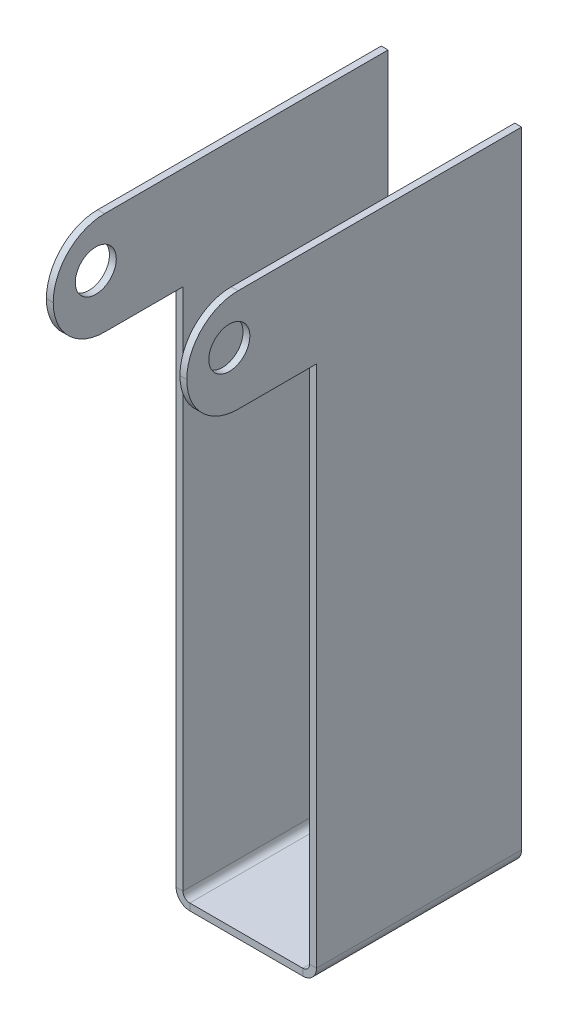
ISO-10303-21;
HEADER;
FILE_DESCRIPTION(('STEP AP214'),'2;1');
FILE_NAME('part.step','',(''),(''),'','','');
FILE_SCHEMA(('AUTOMOTIVE_DESIGN { 1 0 10303 214 1 1 1 1 }'));
ENDSEC;
DATA;
#1=APPLICATION_CONTEXT('core data for automotive mechanical design processes');
#2=APPLICATION_PROTOCOL_DEFINITION('international standard','automotive_design',2000,#1);
#3=PRODUCT_CONTEXT('',#1,'mechanical');
#4=PRODUCT('Part','Part','',(#3));
#5=PRODUCT_RELATED_PRODUCT_CATEGORY('part','',(#4));
#6=PRODUCT_DEFINITION_FORMATION('','',#4);
#7=PRODUCT_DEFINITION_CONTEXT('part definition',#1,'design');
#8=PRODUCT_DEFINITION('design','',#6,#7);
#9=PRODUCT_DEFINITION_SHAPE('','',#8);
#10=(LENGTH_UNIT() NAMED_UNIT(*) SI_UNIT(.MILLI.,.METRE.));
#11=(NAMED_UNIT(*) PLANE_ANGLE_UNIT() SI_UNIT($,.RADIAN.));
#12=(NAMED_UNIT(*) SI_UNIT($,.STERADIAN.) SOLID_ANGLE_UNIT());
#13=UNCERTAINTY_MEASURE_WITH_UNIT(LENGTH_MEASURE(1.E-05),#10,'distance_accuracy_value','');
#14=(GEOMETRIC_REPRESENTATION_CONTEXT(3) GLOBAL_UNCERTAINTY_ASSIGNED_CONTEXT((#13)) GLOBAL_UNIT_ASSIGNED_CONTEXT((#10,
#11,#12)) REPRESENTATION_CONTEXT('',''));
#15=CARTESIAN_POINT('',(0.,0.,0.));
#16=DIRECTION('',(0.,0.,1.));
#17=DIRECTION('',(1.,0.,0.));
#18=AXIS2_PLACEMENT_3D('',#15,#16,#17);
#19=CARTESIAN_POINT('',(-1.00000000000032,92.54,30.));
#20=DIRECTION('',(0.,0.,-1.));
#21=DIRECTION('',(-1.,0.,0.));
#22=AXIS2_PLACEMENT_3D('',#19,#20,#21);
#23=PLANE('',#22);
#24=DIRECTION('',(-1.,0.,0.));
#25=VECTOR('',#24,1.);
#26=CARTESIAN_POINT('',(-2.7148422399037E-13,77.54,30.));
#27=LINE('',#26,#25);
#28=CARTESIAN_POINT('',(-2.7148422399037E-13,77.54,30.));
#29=VERTEX_POINT('',#28);
#30=CARTESIAN_POINT('',(-1.00000000000027,77.54,30.));
#31=VERTEX_POINT('',#30);
#32=EDGE_CURVE('E175',#29,#31,#27,.T.);
#33=ORIENTED_EDGE('',*,*,#32,.T.);
#34=DIRECTION('',(0.,1.,0.));
#35=VECTOR('',#34,1.);
#36=CARTESIAN_POINT('',(-1.00000000000032,92.54,30.));
#37=LINE('',#36,#35);
#38=CARTESIAN_POINT('',(-1.,0.999999999999993,30.));
#39=VERTEX_POINT('',#38);
#40=EDGE_CURVE('E201',#39,#31,#37,.T.);
#41=ORIENTED_EDGE('',*,*,#40,.F.);
#42=DIRECTION('',(-1.,0.,0.));
#43=VECTOR('',#42,1.);
#44=CARTESIAN_POINT('',(0.,0.999999999999997,30.));
#45=LINE('',#44,#43);
#46=CARTESIAN_POINT('',(0.,0.999999999999997,30.));
#47=VERTEX_POINT('',#46);
#48=EDGE_CURVE('E188',#47,#39,#45,.T.);
#49=ORIENTED_EDGE('',*,*,#48,.F.);
#50=DIRECTION('',(0.,1.,0.));
#51=VECTOR('',#50,1.);
#52=CARTESIAN_POINT('',(-3.23101683096544E-13,92.54,30.));
#53=LINE('',#52,#51);
#54=EDGE_CURVE('E169',#47,#29,#53,.T.);
#55=ORIENTED_EDGE('',*,*,#54,.T.);
#56=EDGE_LOOP('',(#33,#41,#49,#55));
#57=FACE_BOUND('',#56,.T.);
#58=ADVANCED_FACE('F39',(#57),#23,.F.);
#59=CARTESIAN_POINT('',(0.,-1.,30.));
#60=DIRECTION('',(0.,1.,0.));
#61=DIRECTION('',(0.,0.,1.));
#62=AXIS2_PLACEMENT_3D('',#59,#60,#61);
#63=PLANE('',#62);
#64=DIRECTION('',(0.,0.,1.));
#65=VECTOR('',#64,1.);
#66=CARTESIAN_POINT('',(0.999999999999997,-1.,30.));
#67=LINE('',#66,#65);
#68=CARTESIAN_POINT('',(0.999999999999997,-1.,30.));
#69=VERTEX_POINT('',#68);
#70=CARTESIAN_POINT('',(0.999999999999997,-1.,0.));
#71=VERTEX_POINT('',#70);
#72=EDGE_CURVE('E206',#69,#71,#67,.F.);
#73=ORIENTED_EDGE('',*,*,#72,.T.);
#74=DIRECTION('',(1.,0.,0.));
#75=VECTOR('',#74,1.);
#76=CARTESIAN_POINT('',(0.,-1.,0.));
#77=LINE('',#76,#75);
#78=CARTESIAN_POINT('',(17.53,-1.,0.));
#79=VERTEX_POINT('',#78);
#80=EDGE_CURVE('E279',#71,#79,#77,.T.);
#81=ORIENTED_EDGE('',*,*,#80,.T.);
#82=DIRECTION('',(0.,0.,-1.));
#83=VECTOR('',#82,1.);
#84=CARTESIAN_POINT('',(17.53,-1.,0.));
#85=LINE('',#84,#83);
#86=CARTESIAN_POINT('',(17.53,-1.,30.));
#87=VERTEX_POINT('',#86);
#88=EDGE_CURVE('E258',#79,#87,#85,.F.);
#89=ORIENTED_EDGE('',*,*,#88,.T.);
#90=DIRECTION('',(1.,0.,0.));
#91=VECTOR('',#90,1.);
#92=CARTESIAN_POINT('',(0.,-1.,30.));
#93=LINE('',#92,#91);
#94=EDGE_CURVE('E281',#69,#87,#93,.T.);
#95=ORIENTED_EDGE('',*,*,#94,.F.);
#96=EDGE_LOOP('',(#73,#81,#89,#95));
#97=FACE_BOUND('',#96,.T.);
#98=ADVANCED_FACE('F368',(#97),#63,.F.);
#99=CARTESIAN_POINT('',(0.,0.,30.));
#100=DIRECTION('',(0.,1.,0.));
#101=DIRECTION('',(0.,0.,1.));
#102=AXIS2_PLACEMENT_3D('',#99,#100,#101);
#103=PLANE('',#102);
#104=DIRECTION('',(1.,0.,0.));
#105=VECTOR('',#104,1.);
#106=CARTESIAN_POINT('',(0.,0.,0.));
#107=LINE('',#106,#105);
#108=CARTESIAN_POINT('',(0.999999999999997,0.,0.));
#109=VERTEX_POINT('',#108);
#110=CARTESIAN_POINT('',(17.53,0.,0.));
#111=VERTEX_POINT('',#110);
#112=EDGE_CURVE('E284',#109,#111,#107,.T.);
#113=ORIENTED_EDGE('',*,*,#112,.F.);
#114=DIRECTION('',(0.,0.,1.));
#115=VECTOR('',#114,1.);
#116=CARTESIAN_POINT('',(0.999999999999997,0.,30.));
#117=LINE('',#116,#115);
#118=CARTESIAN_POINT('',(0.999999999999997,0.,30.));
#119=VERTEX_POINT('',#118);
#120=EDGE_CURVE('E219',#119,#109,#117,.F.);
#121=ORIENTED_EDGE('',*,*,#120,.F.);
#122=DIRECTION('',(1.,0.,0.));
#123=VECTOR('',#122,1.);
#124=CARTESIAN_POINT('',(0.,0.,30.));
#125=LINE('',#124,#123);
#126=CARTESIAN_POINT('',(17.53,0.,30.));
#127=VERTEX_POINT('',#126);
#128=EDGE_CURVE('E283',#119,#127,#125,.T.);
#129=ORIENTED_EDGE('',*,*,#128,.T.);
#130=DIRECTION('',(0.,0.,-1.));
#131=VECTOR('',#130,1.);
#132=CARTESIAN_POINT('',(17.53,0.,0.));
#133=LINE('',#132,#131);
#134=EDGE_CURVE('E271',#111,#127,#133,.F.);
#135=ORIENTED_EDGE('',*,*,#134,.F.);
#136=EDGE_LOOP('',(#113,#121,#129,#135));
#137=FACE_BOUND('',#136,.T.);
#138=ADVANCED_FACE('F373',(#137),#103,.T.);
#139=CARTESIAN_POINT('',(0.,0.,30.));
#140=DIRECTION('',(0.,0.,-1.));
#141=DIRECTION('',(-1.,0.,0.));
#142=AXIS2_PLACEMENT_3D('',#139,#140,#141);
#143=PLANE('',#142);
#144=DIRECTION('',(0.,-1.,0.));
#145=VECTOR('',#144,1.);
#146=CARTESIAN_POINT('',(0.999999999999997,0.,30.));
#147=LINE('',#146,#145);
#148=EDGE_CURVE('E213',#119,#69,#147,.T.);
#149=ORIENTED_EDGE('',*,*,#148,.T.);
#150=ORIENTED_EDGE('',*,*,#94,.T.);
#151=DIRECTION('',(0.,-1.,0.));
#152=VECTOR('',#151,1.);
#153=CARTESIAN_POINT('',(17.53,0.,30.));
#154=LINE('',#153,#152);
#155=EDGE_CURVE('E276',#127,#87,#154,.T.);
#156=ORIENTED_EDGE('',*,*,#155,.F.);
#157=ORIENTED_EDGE('',*,*,#128,.F.);
#158=EDGE_LOOP('',(#149,#150,#156,#157));
#159=FACE_BOUND('',#158,.T.);
#160=ADVANCED_FACE('F433',(#159),#143,.F.);
#161=CARTESIAN_POINT('',(0.,0.,0.));
#162=DIRECTION('',(0.,0.,-1.));
#163=DIRECTION('',(-1.,0.,0.));
#164=AXIS2_PLACEMENT_3D('',#161,#162,#163);
#165=PLANE('',#164);
#166=DIRECTION('',(0.,-1.,0.));
#167=VECTOR('',#166,1.);
#168=CARTESIAN_POINT('',(0.999999999999997,0.,0.));
#169=LINE('',#168,#167);
#170=EDGE_CURVE('E224',#109,#71,#169,.T.);
#171=ORIENTED_EDGE('',*,*,#170,.F.);
#172=ORIENTED_EDGE('',*,*,#112,.T.);
#173=DIRECTION('',(0.,-1.,0.));
#174=VECTOR('',#173,1.);
#175=CARTESIAN_POINT('',(17.53,0.,0.));
#176=LINE('',#175,#174);
#177=EDGE_CURVE('E265',#111,#79,#176,.T.);
#178=ORIENTED_EDGE('',*,*,#177,.T.);
#179=ORIENTED_EDGE('',*,*,#80,.F.);
#180=EDGE_LOOP('',(#171,#172,#178,#179));
#181=FACE_BOUND('',#180,.T.);
#182=ADVANCED_FACE('F428',(#181),#165,.T.);
#183=CARTESIAN_POINT('',(17.53,1.,30.));
#184=DIRECTION('',(0.,0.,1.));
#185=DIRECTION('',(1.,0.,0.));
#186=AXIS2_PLACEMENT_3D('',#183,#184,#185);
#187=PLANE('',#186);
#188=DIRECTION('',(1.,0.,0.));
#189=VECTOR('',#188,1.);
#190=CARTESIAN_POINT('',(18.53,0.999999999999997,30.));
#191=LINE('',#190,#189);
#192=CARTESIAN_POINT('',(18.53,0.999999999999997,30.));
#193=VERTEX_POINT('',#192);
#194=CARTESIAN_POINT('',(19.53,0.999999999999994,30.));
#195=VERTEX_POINT('',#194);
#196=EDGE_CURVE('E227',#193,#195,#191,.T.);
#197=ORIENTED_EDGE('',*,*,#196,.F.);
#198=CARTESIAN_POINT('',(17.53,1.,30.));
#199=DIRECTION('',(0.,0.,-1.));
#200=DIRECTION('',(-1.,0.,0.));
#201=AXIS2_PLACEMENT_3D('',#198,#199,#200);
#202=CIRCLE('',#201,1.);
#203=EDGE_CURVE('E268',#127,#193,#202,.F.);
#204=ORIENTED_EDGE('',*,*,#203,.F.);
#205=ORIENTED_EDGE('',*,*,#155,.T.);
#206=CARTESIAN_POINT('',(17.53,1.,30.));
#207=DIRECTION('',(0.,0.,-1.));
#208=DIRECTION('',(-1.,0.,0.));
#209=AXIS2_PLACEMENT_3D('',#206,#207,#208);
#210=CIRCLE('',#209,2.);
#211=EDGE_CURVE('E261',#87,#195,#210,.F.);
#212=ORIENTED_EDGE('',*,*,#211,.T.);
#213=EDGE_LOOP('',(#197,#204,#205,#212));
#214=FACE_BOUND('',#213,.T.);
#215=ADVANCED_FACE('F425',(#214),#187,.T.);
#216=CARTESIAN_POINT('',(17.53,1.,0.));
#217=DIRECTION('',(0.,0.,1.));
#218=DIRECTION('',(1.,0.,0.));
#219=AXIS2_PLACEMENT_3D('',#216,#217,#218);
#220=PLANE('',#219);
#221=CARTESIAN_POINT('',(17.53,1.,0.));
#222=DIRECTION('',(0.,0.,-1.));
#223=DIRECTION('',(-1.,0.,0.));
#224=AXIS2_PLACEMENT_3D('',#221,#222,#223);
#225=CIRCLE('',#224,1.);
#226=CARTESIAN_POINT('',(18.53,0.999999999999997,0.));
#227=VERTEX_POINT('',#226);
#228=EDGE_CURVE('E257',#227,#111,#225,.T.);
#229=ORIENTED_EDGE('',*,*,#228,.F.);
#230=DIRECTION('',(1.,0.,0.));
#231=VECTOR('',#230,1.);
#232=CARTESIAN_POINT('',(18.53,0.999999999999997,0.));
#233=LINE('',#232,#231);
#234=CARTESIAN_POINT('',(19.53,0.999999999999994,0.));
#235=VERTEX_POINT('',#234);
#236=EDGE_CURVE('E232',#227,#235,#233,.T.);
#237=ORIENTED_EDGE('',*,*,#236,.T.);
#238=CARTESIAN_POINT('',(17.53,1.,0.));
#239=DIRECTION('',(0.,0.,-1.));
#240=DIRECTION('',(-1.,0.,0.));
#241=AXIS2_PLACEMENT_3D('',#238,#239,#240);
#242=CIRCLE('',#241,2.);
#243=EDGE_CURVE('E262',#235,#79,#242,.T.);
#244=ORIENTED_EDGE('',*,*,#243,.T.);
#245=ORIENTED_EDGE('',*,*,#177,.F.);
#246=EDGE_LOOP('',(#229,#237,#244,#245));
#247=FACE_BOUND('',#246,.T.);
#248=ADVANCED_FACE('F420',(#247),#220,.F.);
#249=CARTESIAN_POINT('',(17.53,1.,0.));
#250=DIRECTION('',(0.,0.,-1.));
#251=DIRECTION('',(1.,0.,0.));
#252=AXIS2_PLACEMENT_3D('',#249,#250,#251);
#253=CYLINDRICAL_SURFACE('',#252,2.);
#254=ORIENTED_EDGE('',*,*,#88,.F.);
#255=ORIENTED_EDGE('',*,*,#243,.F.);
#256=DIRECTION('',(0.,0.,1.));
#257=VECTOR('',#256,1.);
#258=CARTESIAN_POINT('',(19.53,0.999999999999994,0.));
#259=LINE('',#258,#257);
#260=EDGE_CURVE('E235',#235,#195,#259,.T.);
#261=ORIENTED_EDGE('',*,*,#260,.T.);
#262=ORIENTED_EDGE('',*,*,#211,.F.);
#263=EDGE_LOOP('',(#254,#255,#261,#262));
#264=FACE_BOUND('',#263,.T.);
#265=ADVANCED_FACE('F417',(#264),#253,.T.);
#266=CARTESIAN_POINT('',(17.53,1.,0.));
#267=DIRECTION('',(0.,0.,-1.));
#268=DIRECTION('',(1.,0.,0.));
#269=AXIS2_PLACEMENT_3D('',#266,#267,#268);
#270=CYLINDRICAL_SURFACE('',#269,1.);
#271=ORIENTED_EDGE('',*,*,#134,.T.);
#272=ORIENTED_EDGE('',*,*,#203,.T.);
#273=DIRECTION('',(0.,0.,-1.));
#274=VECTOR('',#273,1.);
#275=CARTESIAN_POINT('',(18.53,0.999999999999997,30.));
#276=LINE('',#275,#274);
#277=EDGE_CURVE('E230',#193,#227,#276,.T.);
#278=ORIENTED_EDGE('',*,*,#277,.T.);
#279=ORIENTED_EDGE('',*,*,#228,.T.);
#280=EDGE_LOOP('',(#271,#272,#278,#279));
#281=FACE_BOUND('',#280,.T.);
#282=ADVANCED_FACE('F415',(#281),#270,.F.);
#283=CARTESIAN_POINT('',(19.53,0.,30.));
#284=DIRECTION('',(0.,0.,-1.));
#285=DIRECTION('',(-1.,0.,0.));
#286=AXIS2_PLACEMENT_3D('',#283,#284,#285);
#287=PLANE('',#286);
#288=DIRECTION('',(0.,-1.,0.));
#289=VECTOR('',#288,1.);
#290=CARTESIAN_POINT('',(19.53,0.,30.));
#291=LINE('',#290,#289);
#292=CARTESIAN_POINT('',(19.5300000000003,77.54,30.));
#293=VERTEX_POINT('',#292);
#294=EDGE_CURVE('E241',#293,#195,#291,.T.);
#295=ORIENTED_EDGE('',*,*,#294,.F.);
#296=DIRECTION('',(1.,0.,0.));
#297=VECTOR('',#296,1.);
#298=CARTESIAN_POINT('',(18.5300000000003,77.54,30.));
#299=LINE('',#298,#297);
#300=CARTESIAN_POINT('',(18.5300000000003,77.54,30.));
#301=VERTEX_POINT('',#300);
#302=EDGE_CURVE('E339',#301,#293,#299,.T.);
#303=ORIENTED_EDGE('',*,*,#302,.F.);
#304=DIRECTION('',(0.,-1.,0.));
#305=VECTOR('',#304,1.);
#306=CARTESIAN_POINT('',(18.53,0.,30.));
#307=LINE('',#306,#305);
#308=EDGE_CURVE('E240',#301,#193,#307,.T.);
#309=ORIENTED_EDGE('',*,*,#308,.T.);
#310=ORIENTED_EDGE('',*,*,#196,.T.);
#311=EDGE_LOOP('',(#295,#303,#309,#310));
#312=FACE_BOUND('',#311,.T.);
#313=ADVANCED_FACE('F411',(#312),#287,.F.);
#314=CARTESIAN_POINT('',(19.5300000000003,92.54,0.));
#315=DIRECTION('',(0.,0.,1.));
#316=DIRECTION('',(1.,0.,0.));
#317=AXIS2_PLACEMENT_3D('',#314,#315,#316);
#318=PLANE('',#317);
#319=ORIENTED_EDGE('',*,*,#236,.F.);
#320=DIRECTION('',(0.,1.,0.));
#321=VECTOR('',#320,1.);
#322=CARTESIAN_POINT('',(18.5300000000003,92.54,0.));
#323=LINE('',#322,#321);
#324=CARTESIAN_POINT('',(18.5300000000003,92.54,0.));
#325=VERTEX_POINT('',#324);
#326=EDGE_CURVE('E251',#227,#325,#323,.T.);
#327=ORIENTED_EDGE('',*,*,#326,.T.);
#328=DIRECTION('',(-1.,0.,0.));
#329=VECTOR('',#328,1.);
#330=CARTESIAN_POINT('',(19.5300000000003,92.54,0.));
#331=LINE('',#330,#329);
#332=CARTESIAN_POINT('',(19.5300000000003,92.54,0.));
#333=VERTEX_POINT('',#332);
#334=EDGE_CURVE('E249',#333,#325,#331,.T.);
#335=ORIENTED_EDGE('',*,*,#334,.F.);
#336=DIRECTION('',(0.,1.,0.));
#337=VECTOR('',#336,1.);
#338=CARTESIAN_POINT('',(19.5300000000003,92.54,0.));
#339=LINE('',#338,#337);
#340=EDGE_CURVE('E243',#235,#333,#339,.T.);
#341=ORIENTED_EDGE('',*,*,#340,.F.);
#342=EDGE_LOOP('',(#319,#327,#335,#341));
#343=FACE_BOUND('',#342,.T.);
#344=ADVANCED_FACE('F401',(#343),#318,.F.);
#345=CARTESIAN_POINT('',(19.53,0.,0.));
#346=DIRECTION('',(-1.,0.,0.));
#347=DIRECTION('',(0.,-1.,0.));
#348=AXIS2_PLACEMENT_3D('',#345,#346,#347);
#349=PLANE('',#348);
#350=CARTESIAN_POINT('',(19.5300000000003,85.96,42.7463768961494));
#351=DIRECTION('',(1.,0.,0.));
#352=DIRECTION('',(0.,1.,0.));
#353=AXIS2_PLACEMENT_3D('',#350,#351,#352);
#354=CIRCLE('',#353,3.);
#355=CARTESIAN_POINT('',(19.5300000000003,88.96,42.7463768961494));
#356=VERTEX_POINT('',#355);
#357=EDGE_CURVE('E315',#356,#356,#354,.T.);
#358=ORIENTED_EDGE('',*,*,#357,.F.);
#359=EDGE_LOOP('',(#358));
#360=FACE_BOUND('',#359,.T.);
#361=CARTESIAN_POINT('',(19.5300000000003,85.04,41.47));
#362=DIRECTION('',(-1.,0.,0.));
#363=DIRECTION('',(0.,-1.,0.));
#364=AXIS2_PLACEMENT_3D('',#361,#362,#363);
#365=CIRCLE('',#364,7.5);
#366=CARTESIAN_POINT('',(19.5300000000003,92.54,41.47));
#367=VERTEX_POINT('',#366);
#368=CARTESIAN_POINT('',(19.5300000000003,85.04,48.97));
#369=VERTEX_POINT('',#368);
#370=EDGE_CURVE('E286',#367,#369,#365,.F.);
#371=ORIENTED_EDGE('',*,*,#370,.T.);
#372=CARTESIAN_POINT('',(19.5300000000003,85.04,41.47));
#373=DIRECTION('',(-1.,0.,0.));
#374=DIRECTION('',(0.,-1.,0.));
#375=AXIS2_PLACEMENT_3D('',#372,#373,#374);
#376=CIRCLE('',#375,7.5);
#377=CARTESIAN_POINT('',(19.5300000000003,77.54,41.47));
#378=VERTEX_POINT('',#377);
#379=EDGE_CURVE('E296',#369,#378,#376,.F.);
#380=ORIENTED_EDGE('',*,*,#379,.T.);
#381=DIRECTION('',(0.,0.,-1.));
#382=VECTOR('',#381,1.);
#383=CARTESIAN_POINT('',(19.5300000000003,77.54,30.));
#384=LINE('',#383,#382);
#385=EDGE_CURVE('E184',#378,#293,#384,.T.);
#386=ORIENTED_EDGE('',*,*,#385,.T.);
#387=ORIENTED_EDGE('',*,*,#294,.T.);
#388=ORIENTED_EDGE('',*,*,#260,.F.);
#389=ORIENTED_EDGE('',*,*,#340,.T.);
#390=DIRECTION('',(0.,0.,1.));
#391=VECTOR('',#390,1.);
#392=CARTESIAN_POINT('',(19.5300000000003,92.54,30.));
#393=LINE('',#392,#391);
#394=EDGE_CURVE('E246',#333,#367,#393,.T.);
#395=ORIENTED_EDGE('',*,*,#394,.T.);
#396=EDGE_LOOP('',(#371,#380,#386,#387,#388,#389,#395));
#397=FACE_BOUND('',#396,.T.);
#398=ADVANCED_FACE('F397',(#360,#397),#349,.F.);
#399=CARTESIAN_POINT('',(18.53,0.,0.));
#400=DIRECTION('',(-1.,0.,0.));
#401=DIRECTION('',(0.,-1.,0.));
#402=AXIS2_PLACEMENT_3D('',#399,#400,#401);
#403=PLANE('',#402);
#404=CARTESIAN_POINT('',(18.5300000000003,85.96,42.7463768961494));
#405=DIRECTION('',(-1.,0.,0.));
#406=DIRECTION('',(0.,-1.,0.));
#407=AXIS2_PLACEMENT_3D('',#404,#405,#406);
#408=CIRCLE('',#407,3.);
#409=CARTESIAN_POINT('',(18.5300000000003,82.96,42.7463768961494));
#410=VERTEX_POINT('',#409);
#411=EDGE_CURVE('E293',#410,#410,#408,.T.);
#412=ORIENTED_EDGE('',*,*,#411,.F.);
#413=EDGE_LOOP('',(#412));
#414=FACE_BOUND('',#413,.T.);
#415=DIRECTION('',(0.,0.,-1.));
#416=VECTOR('',#415,1.);
#417=CARTESIAN_POINT('',(18.5300000000003,77.54,30.));
#418=LINE('',#417,#416);
#419=CARTESIAN_POINT('',(18.5300000000003,77.54,41.47));
#420=VERTEX_POINT('',#419);
#421=EDGE_CURVE('E344',#420,#301,#418,.T.);
#422=ORIENTED_EDGE('',*,*,#421,.F.);
#423=CARTESIAN_POINT('',(18.5300000000003,85.04,41.47));
#424=DIRECTION('',(-1.,0.,0.));
#425=DIRECTION('',(0.,-1.,0.));
#426=AXIS2_PLACEMENT_3D('',#423,#424,#425);
#427=CIRCLE('',#426,7.5);
#428=CARTESIAN_POINT('',(18.5300000000003,85.04,48.97));
#429=VERTEX_POINT('',#428);
#430=EDGE_CURVE('E303',#420,#429,#427,.T.);
#431=ORIENTED_EDGE('',*,*,#430,.T.);
#432=CARTESIAN_POINT('',(18.5300000000003,85.04,41.47));
#433=DIRECTION('',(-1.,0.,0.));
#434=DIRECTION('',(0.,-1.,0.));
#435=AXIS2_PLACEMENT_3D('',#432,#433,#434);
#436=CIRCLE('',#435,7.5);
#437=CARTESIAN_POINT('',(18.5300000000003,92.54,41.47));
#438=VERTEX_POINT('',#437);
#439=EDGE_CURVE('E301',#429,#438,#436,.T.);
#440=ORIENTED_EDGE('',*,*,#439,.T.);
#441=DIRECTION('',(0.,0.,1.));
#442=VECTOR('',#441,1.);
#443=CARTESIAN_POINT('',(18.5300000000003,92.54,30.));
#444=LINE('',#443,#442);
#445=EDGE_CURVE('E244',#325,#438,#444,.T.);
#446=ORIENTED_EDGE('',*,*,#445,.F.);
#447=ORIENTED_EDGE('',*,*,#326,.F.);
#448=ORIENTED_EDGE('',*,*,#277,.F.);
#449=ORIENTED_EDGE('',*,*,#308,.F.);
#450=EDGE_LOOP('',(#422,#431,#440,#446,#447,#448,#449));
#451=FACE_BOUND('',#450,.T.);
#452=ADVANCED_FACE('F400',(#414,#451),#403,.T.);
#453=CARTESIAN_POINT('',(19.5300000000003,92.54,30.));
#454=DIRECTION('',(0.,-1.,0.));
#455=DIRECTION('',(1.,0.,0.));
#456=AXIS2_PLACEMENT_3D('',#453,#454,#455);
#457=PLANE('',#456);
#458=ORIENTED_EDGE('',*,*,#445,.T.);
#459=DIRECTION('',(1.,0.,0.));
#460=VECTOR('',#459,1.);
#461=CARTESIAN_POINT('',(19.5300000000003,92.54,41.47));
#462=LINE('',#461,#460);
#463=EDGE_CURVE('E11',#438,#367,#462,.T.);
#464=ORIENTED_EDGE('',*,*,#463,.T.);
#465=ORIENTED_EDGE('',*,*,#394,.F.);
#466=ORIENTED_EDGE('',*,*,#334,.T.);
#467=EDGE_LOOP('',(#458,#464,#465,#466));
#468=FACE_BOUND('',#467,.T.);
#469=ADVANCED_FACE('F392',(#468),#457,.F.);
#470=CARTESIAN_POINT('',(0.999999999999997,1.,0.));
#471=DIRECTION('',(0.,0.,-1.));
#472=DIRECTION('',(-1.,0.,0.));
#473=AXIS2_PLACEMENT_3D('',#470,#471,#472);
#474=PLANE('',#473);
#475=DIRECTION('',(-1.,0.,0.));
#476=VECTOR('',#475,1.);
#477=CARTESIAN_POINT('',(0.,0.999999999999997,0.));
#478=LINE('',#477,#476);
#479=CARTESIAN_POINT('',(0.,0.999999999999997,0.));
#480=VERTEX_POINT('',#479);
#481=CARTESIAN_POINT('',(-1.,0.999999999999993,0.));
#482=VERTEX_POINT('',#481);
#483=EDGE_CURVE('E335',#480,#482,#478,.T.);
#484=ORIENTED_EDGE('',*,*,#483,.F.);
#485=CARTESIAN_POINT('',(0.999999999999997,1.,0.));
#486=DIRECTION('',(0.,0.,1.));
#487=DIRECTION('',(1.,0.,0.));
#488=AXIS2_PLACEMENT_3D('',#485,#486,#487);
#489=CIRCLE('',#488,1.);
#490=EDGE_CURVE('E216',#109,#480,#489,.F.);
#491=ORIENTED_EDGE('',*,*,#490,.F.);
#492=ORIENTED_EDGE('',*,*,#170,.T.);
#493=CARTESIAN_POINT('',(0.999999999999997,1.,0.));
#494=DIRECTION('',(0.,0.,1.));
#495=DIRECTION('',(1.,0.,0.));
#496=AXIS2_PLACEMENT_3D('',#493,#494,#495);
#497=CIRCLE('',#496,2.);
#498=EDGE_CURVE('E209',#71,#482,#497,.F.);
#499=ORIENTED_EDGE('',*,*,#498,.T.);
#500=EDGE_LOOP('',(#484,#491,#492,#499));
#501=FACE_BOUND('',#500,.T.);
#502=ADVANCED_FACE('F389',(#501),#474,.T.);
#503=CARTESIAN_POINT('',(0.999999999999997,1.,30.));
#504=DIRECTION('',(0.,0.,-1.));
#505=DIRECTION('',(-1.,0.,0.));
#506=AXIS2_PLACEMENT_3D('',#503,#504,#505);
#507=PLANE('',#506);
#508=CARTESIAN_POINT('',(0.999999999999997,1.,30.));
#509=DIRECTION('',(0.,0.,1.));
#510=DIRECTION('',(1.,0.,0.));
#511=AXIS2_PLACEMENT_3D('',#508,#509,#510);
#512=CIRCLE('',#511,1.);
#513=EDGE_CURVE('E205',#47,#119,#512,.T.);
#514=ORIENTED_EDGE('',*,*,#513,.F.);
#515=ORIENTED_EDGE('',*,*,#48,.T.);
#516=CARTESIAN_POINT('',(0.999999999999997,1.,30.));
#517=DIRECTION('',(0.,0.,1.));
#518=DIRECTION('',(1.,0.,0.));
#519=AXIS2_PLACEMENT_3D('',#516,#517,#518);
#520=CIRCLE('',#519,2.);
#521=EDGE_CURVE('E210',#39,#69,#520,.T.);
#522=ORIENTED_EDGE('',*,*,#521,.T.);
#523=ORIENTED_EDGE('',*,*,#148,.F.);
#524=EDGE_LOOP('',(#514,#515,#522,#523));
#525=FACE_BOUND('',#524,.T.);
#526=ADVANCED_FACE('F383',(#525),#507,.F.);
#527=CARTESIAN_POINT('',(0.999999999999997,1.,30.));
#528=DIRECTION('',(0.,0.,1.));
#529=DIRECTION('',(-1.,0.,0.));
#530=AXIS2_PLACEMENT_3D('',#527,#528,#529);
#531=CYLINDRICAL_SURFACE('',#530,2.);
#532=ORIENTED_EDGE('',*,*,#72,.F.);
#533=ORIENTED_EDGE('',*,*,#521,.F.);
#534=DIRECTION('',(0.,0.,-1.));
#535=VECTOR('',#534,1.);
#536=CARTESIAN_POINT('',(-1.,0.999999999999993,0.));
#537=LINE('',#536,#535);
#538=EDGE_CURVE('E190',#39,#482,#537,.T.);
#539=ORIENTED_EDGE('',*,*,#538,.T.);
#540=ORIENTED_EDGE('',*,*,#498,.F.);
#541=EDGE_LOOP('',(#532,#533,#539,#540));
#542=FACE_BOUND('',#541,.T.);
#543=ADVANCED_FACE('F379',(#542),#531,.T.);
#544=CARTESIAN_POINT('',(0.999999999999997,1.,30.));
#545=DIRECTION('',(0.,0.,1.));
#546=DIRECTION('',(-1.,0.,0.));
#547=AXIS2_PLACEMENT_3D('',#544,#545,#546);
#548=CYLINDRICAL_SURFACE('',#547,1.);
#549=ORIENTED_EDGE('',*,*,#120,.T.);
#550=ORIENTED_EDGE('',*,*,#490,.T.);
#551=DIRECTION('',(0.,0.,1.));
#552=VECTOR('',#551,1.);
#553=CARTESIAN_POINT('',(0.,0.999999999999997,0.));
#554=LINE('',#553,#552);
#555=EDGE_CURVE('E338',#480,#47,#554,.T.);
#556=ORIENTED_EDGE('',*,*,#555,.T.);
#557=ORIENTED_EDGE('',*,*,#513,.T.);
#558=EDGE_LOOP('',(#549,#550,#556,#557));
#559=FACE_BOUND('',#558,.T.);
#560=ADVANCED_FACE('F382',(#559),#548,.F.);
#561=CARTESIAN_POINT('',(-1.,0.,0.));
#562=DIRECTION('',(0.,0.,1.));
#563=DIRECTION('',(1.,0.,0.));
#564=AXIS2_PLACEMENT_3D('',#561,#562,#563);
#565=PLANE('',#564);
#566=ORIENTED_EDGE('',*,*,#483,.T.);
#567=DIRECTION('',(0.,-1.,0.));
#568=VECTOR('',#567,1.);
#569=CARTESIAN_POINT('',(-1.,0.,0.));
#570=LINE('',#569,#568);
#571=CARTESIAN_POINT('',(-1.00000000000032,92.54,0.));
#572=VERTEX_POINT('',#571);
#573=EDGE_CURVE('E196',#572,#482,#570,.T.);
#574=ORIENTED_EDGE('',*,*,#573,.F.);
#575=DIRECTION('',(1.,0.,0.));
#576=VECTOR('',#575,1.);
#577=CARTESIAN_POINT('',(-1.00000000000032,92.54,0.));
#578=LINE('',#577,#576);
#579=CARTESIAN_POINT('',(-3.23101683096544E-13,92.54,0.));
#580=VERTEX_POINT('',#579);
#581=EDGE_CURVE('E202',#572,#580,#578,.T.);
#582=ORIENTED_EDGE('',*,*,#581,.T.);
#583=DIRECTION('',(0.,-1.,0.));
#584=VECTOR('',#583,1.);
#585=CARTESIAN_POINT('',(0.,0.,0.));
#586=LINE('',#585,#584);
#587=EDGE_CURVE('E192',#580,#480,#586,.T.);
#588=ORIENTED_EDGE('',*,*,#587,.T.);
#589=EDGE_LOOP('',(#566,#574,#582,#588));
#590=FACE_BOUND('',#589,.T.);
#591=ADVANCED_FACE('F387',(#590),#565,.F.);
#592=CARTESIAN_POINT('',(-1.,0.,0.));
#593=DIRECTION('',(1.,0.,0.));
#594=DIRECTION('',(0.,1.,0.));
#595=AXIS2_PLACEMENT_3D('',#592,#593,#594);
#596=PLANE('',#595);
#597=CARTESIAN_POINT('',(-1.00000000000035,85.9600000000001,42.7463768961494));
#598=DIRECTION('',(1.,0.,0.));
#599=DIRECTION('',(0.,1.,0.));
#600=AXIS2_PLACEMENT_3D('',#597,#598,#599);
#601=CIRCLE('',#600,3.);
#602=CARTESIAN_POINT('',(-1.00000000000034,88.9600000000001,42.7463768961494));
#603=VERTEX_POINT('',#602);
#604=EDGE_CURVE('E294',#603,#603,#601,.T.);
#605=ORIENTED_EDGE('',*,*,#604,.T.);
#606=EDGE_LOOP('',(#605));
#607=FACE_BOUND('',#606,.T.);
#608=DIRECTION('',(0.,0.,-1.));
#609=VECTOR('',#608,1.);
#610=CARTESIAN_POINT('',(-1.00000000000027,77.54,30.));
#611=LINE('',#610,#609);
#612=CARTESIAN_POINT('',(-1.00000000000027,77.54,41.47));
#613=VERTEX_POINT('',#612);
#614=EDGE_CURVE('E176',#613,#31,#611,.T.);
#615=ORIENTED_EDGE('',*,*,#614,.F.);
#616=CARTESIAN_POINT('',(-1.0000000000003,85.04,41.47));
#617=DIRECTION('',(1.,0.,0.));
#618=DIRECTION('',(0.,1.,0.));
#619=AXIS2_PLACEMENT_3D('',#616,#617,#618);
#620=CIRCLE('',#619,7.5);
#621=CARTESIAN_POINT('',(-1.0000000000003,85.04,48.97));
#622=VERTEX_POINT('',#621);
#623=EDGE_CURVE('E309',#613,#622,#620,.F.);
#624=ORIENTED_EDGE('',*,*,#623,.T.);
#625=CARTESIAN_POINT('',(-1.0000000000003,85.04,41.47));
#626=DIRECTION('',(1.,0.,0.));
#627=DIRECTION('',(0.,1.,0.));
#628=AXIS2_PLACEMENT_3D('',#625,#626,#627);
#629=CIRCLE('',#628,7.5);
#630=CARTESIAN_POINT('',(-1.00000000000032,92.54,41.47));
#631=VERTEX_POINT('',#630);
#632=EDGE_CURVE('E307',#622,#631,#629,.F.);
#633=ORIENTED_EDGE('',*,*,#632,.T.);
#634=DIRECTION('',(0.,0.,-1.));
#635=VECTOR('',#634,1.);
#636=CARTESIAN_POINT('',(-1.00000000000032,92.54,0.));
#637=LINE('',#636,#635);
#638=EDGE_CURVE('E329',#631,#572,#637,.T.);
#639=ORIENTED_EDGE('',*,*,#638,.T.);
#640=ORIENTED_EDGE('',*,*,#573,.T.);
#641=ORIENTED_EDGE('',*,*,#538,.F.);
#642=ORIENTED_EDGE('',*,*,#40,.T.);
#643=EDGE_LOOP('',(#615,#624,#633,#639,#640,#641,#642));
#644=FACE_BOUND('',#643,.T.);
#645=ADVANCED_FACE('F327',(#607,#644),#596,.F.);
#646=CARTESIAN_POINT('',(0.,0.,0.));
#647=DIRECTION('',(1.,0.,0.));
#648=DIRECTION('',(0.,1.,0.));
#649=AXIS2_PLACEMENT_3D('',#646,#647,#648);
#650=PLANE('',#649);
#651=CARTESIAN_POINT('',(-3.00107161343988E-13,85.9600000000001,42.7463768961494));
#652=DIRECTION('',(1.,0.,0.));
#653=DIRECTION('',(0.,1.,0.));
#654=AXIS2_PLACEMENT_3D('',#651,#652,#653);
#655=CIRCLE('',#654,3.);
#656=CARTESIAN_POINT('',(-3.10581605360517E-13,88.9600000000001,42.7463768961494));
#657=VERTEX_POINT('',#656);
#658=EDGE_CURVE('E290',#657,#657,#655,.T.);
#659=ORIENTED_EDGE('',*,*,#658,.F.);
#660=EDGE_LOOP('',(#659));
#661=FACE_BOUND('',#660,.T.);
#662=CARTESIAN_POINT('',(-2.9691557305522E-13,85.04,41.47));
#663=DIRECTION('',(1.,0.,0.));
#664=DIRECTION('',(0.,1.,0.));
#665=AXIS2_PLACEMENT_3D('',#662,#663,#664);
#666=CIRCLE('',#665,7.5);
#667=CARTESIAN_POINT('',(-3.23101683096544E-13,92.54,41.47));
#668=VERTEX_POINT('',#667);
#669=CARTESIAN_POINT('',(-2.97505076130022E-13,85.04,48.97));
#670=VERTEX_POINT('',#669);
#671=EDGE_CURVE('E56',#668,#670,#666,.T.);
#672=ORIENTED_EDGE('',*,*,#671,.T.);
#673=CARTESIAN_POINT('',(-2.9691557305522E-13,85.04,41.47));
#674=DIRECTION('',(1.,0.,0.));
#675=DIRECTION('',(0.,1.,0.));
#676=AXIS2_PLACEMENT_3D('',#673,#674,#675);
#677=CIRCLE('',#676,7.5);
#678=CARTESIAN_POINT('',(-2.7148422399037E-13,77.54,41.47));
#679=VERTEX_POINT('',#678);
#680=EDGE_CURVE('E171',#670,#679,#677,.T.);
#681=ORIENTED_EDGE('',*,*,#680,.T.);
#682=DIRECTION('',(0.,0.,-1.));
#683=VECTOR('',#682,1.);
#684=CARTESIAN_POINT('',(-2.7148422399037E-13,77.54,30.));
#685=LINE('',#684,#683);
#686=EDGE_CURVE('E164',#679,#29,#685,.T.);
#687=ORIENTED_EDGE('',*,*,#686,.T.);
#688=ORIENTED_EDGE('',*,*,#54,.F.);
#689=ORIENTED_EDGE('',*,*,#555,.F.);
#690=ORIENTED_EDGE('',*,*,#587,.F.);
#691=DIRECTION('',(0.,0.,-1.));
#692=VECTOR('',#691,1.);
#693=CARTESIAN_POINT('',(-3.23101683096544E-13,92.54,0.));
#694=LINE('',#693,#692);
#695=EDGE_CURVE('E189',#668,#580,#694,.T.);
#696=ORIENTED_EDGE('',*,*,#695,.F.);
#697=EDGE_LOOP('',(#672,#681,#687,#688,#689,#690,#696));
#698=FACE_BOUND('',#697,.T.);
#699=ADVANCED_FACE('F166',(#661,#698),#650,.T.);
#700=CARTESIAN_POINT('',(-1.00000000000032,92.54,0.));
#701=DIRECTION('',(0.,-1.,0.));
#702=DIRECTION('',(1.,0.,0.));
#703=AXIS2_PLACEMENT_3D('',#700,#701,#702);
#704=PLANE('',#703);
#705=ORIENTED_EDGE('',*,*,#638,.F.);
#706=DIRECTION('',(-1.,0.,0.));
#707=VECTOR('',#706,1.);
#708=CARTESIAN_POINT('',(-1.00000000000032,92.54,41.47));
#709=LINE('',#708,#707);
#710=EDGE_CURVE('E48',#631,#668,#709,.F.);
#711=ORIENTED_EDGE('',*,*,#710,.T.);
#712=ORIENTED_EDGE('',*,*,#695,.T.);
#713=ORIENTED_EDGE('',*,*,#581,.F.);
#714=EDGE_LOOP('',(#705,#711,#712,#713));
#715=FACE_BOUND('',#714,.T.);
#716=ADVANCED_FACE('F331',(#715),#704,.F.);
#717=CARTESIAN_POINT('',(18.5300000000003,77.54,30.));
#718=DIRECTION('',(0.,-1.,0.));
#719=DIRECTION('',(1.,0.,0.));
#720=AXIS2_PLACEMENT_3D('',#717,#718,#719);
#721=PLANE('',#720);
#722=ORIENTED_EDGE('',*,*,#385,.F.);
#723=DIRECTION('',(1.,0.,0.));
#724=VECTOR('',#723,1.);
#725=CARTESIAN_POINT('',(18.5300000000003,77.54,41.47));
#726=LINE('',#725,#724);
#727=EDGE_CURVE('E298',#378,#420,#726,.F.);
#728=ORIENTED_EDGE('',*,*,#727,.T.);
#729=ORIENTED_EDGE('',*,*,#421,.T.);
#730=ORIENTED_EDGE('',*,*,#302,.T.);
#731=EDGE_LOOP('',(#722,#728,#729,#730));
#732=FACE_BOUND('',#731,.T.);
#733=ADVANCED_FACE('F365',(#732),#721,.T.);
#734=CARTESIAN_POINT('',(-2.7148422399037E-13,77.54,30.));
#735=DIRECTION('',(0.,1.,0.));
#736=DIRECTION('',(-1.,0.,0.));
#737=AXIS2_PLACEMENT_3D('',#734,#735,#736);
#738=PLANE('',#737);
#739=ORIENTED_EDGE('',*,*,#686,.F.);
#740=DIRECTION('',(-1.,0.,0.));
#741=VECTOR('',#740,1.);
#742=CARTESIAN_POINT('',(-2.7148422399037E-13,77.54,41.47));
#743=LINE('',#742,#741);
#744=EDGE_CURVE('E305',#679,#613,#743,.T.);
#745=ORIENTED_EDGE('',*,*,#744,.T.);
#746=ORIENTED_EDGE('',*,*,#614,.T.);
#747=ORIENTED_EDGE('',*,*,#32,.F.);
#748=EDGE_LOOP('',(#739,#745,#746,#747));
#749=FACE_BOUND('',#748,.T.);
#750=ADVANCED_FACE('F179',(#749),#738,.F.);
#751=CARTESIAN_POINT('',(-1.00000000000035,85.9600000000001,42.7463768961494));
#752=DIRECTION('',(1.,0.,0.));
#753=DIRECTION('',(0.,1.,0.));
#754=AXIS2_PLACEMENT_3D('',#751,#752,#753);
#755=CYLINDRICAL_SURFACE('',#754,3.);
#756=ORIENTED_EDGE('',*,*,#658,.T.);
#757=EDGE_LOOP('',(#756));
#758=FACE_BOUND('',#757,.T.);
#759=ORIENTED_EDGE('',*,*,#604,.F.);
#760=EDGE_LOOP('',(#759));
#761=FACE_BOUND('',#760,.T.);
#762=ADVANCED_FACE('F354',(#758,#761),#755,.F.);
#763=ORIENTED_EDGE('',*,*,#411,.T.);
#764=EDGE_LOOP('',(#763));
#765=FACE_BOUND('',#764,.T.);
#766=ORIENTED_EDGE('',*,*,#357,.T.);
#767=EDGE_LOOP('',(#766));
#768=FACE_BOUND('',#767,.T.);
#769=ADVANCED_FACE('F356',(#765,#768),#755,.F.);
#770=CARTESIAN_POINT('',(19.5300000000003,85.04,41.47));
#771=DIRECTION('',(-1.,0.,0.));
#772=DIRECTION('',(0.,-1.,0.));
#773=AXIS2_PLACEMENT_3D('',#770,#771,#772);
#774=CYLINDRICAL_SURFACE('',#773,7.5);
#775=ORIENTED_EDGE('',*,*,#463,.F.);
#776=ORIENTED_EDGE('',*,*,#439,.F.);
#777=DIRECTION('',(1.,0.,0.));
#778=VECTOR('',#777,1.);
#779=CARTESIAN_POINT('',(18.5300000000003,85.04,48.97));
#780=LINE('',#779,#778);
#781=EDGE_CURVE('E313',#369,#429,#780,.F.);
#782=ORIENTED_EDGE('',*,*,#781,.F.);
#783=ORIENTED_EDGE('',*,*,#370,.F.);
#784=EDGE_LOOP('',(#775,#776,#782,#783));
#785=FACE_BOUND('',#784,.T.);
#786=ADVANCED_FACE('F363',(#785),#774,.T.);
#787=CARTESIAN_POINT('',(18.5300000000003,85.04,41.47));
#788=DIRECTION('',(1.,0.,0.));
#789=DIRECTION('',(0.,1.,0.));
#790=AXIS2_PLACEMENT_3D('',#787,#788,#789);
#791=CYLINDRICAL_SURFACE('',#790,7.5);
#792=ORIENTED_EDGE('',*,*,#430,.F.);
#793=ORIENTED_EDGE('',*,*,#727,.F.);
#794=ORIENTED_EDGE('',*,*,#379,.F.);
#795=ORIENTED_EDGE('',*,*,#781,.T.);
#796=EDGE_LOOP('',(#792,#793,#794,#795));
#797=FACE_BOUND('',#796,.T.);
#798=ADVANCED_FACE('F443',(#797),#791,.T.);
#799=CARTESIAN_POINT('',(-2.97339818228351E-13,85.04,41.47));
#800=DIRECTION('',(-1.,0.,0.));
#801=DIRECTION('',(0.,-1.,0.));
#802=AXIS2_PLACEMENT_3D('',#799,#800,#801);
#803=CYLINDRICAL_SURFACE('',#802,7.5);
#804=DIRECTION('',(-1.,0.,0.));
#805=VECTOR('',#804,1.);
#806=CARTESIAN_POINT('',(-2.97339818228351E-13,85.04,48.97));
#807=LINE('',#806,#805);
#808=EDGE_CURVE('E43',#670,#622,#807,.T.);
#809=ORIENTED_EDGE('',*,*,#808,.F.);
#810=ORIENTED_EDGE('',*,*,#671,.F.);
#811=ORIENTED_EDGE('',*,*,#710,.F.);
#812=ORIENTED_EDGE('',*,*,#632,.F.);
#813=EDGE_LOOP('',(#809,#810,#811,#812));
#814=FACE_BOUND('',#813,.T.);
#815=ADVANCED_FACE('F41',(#814),#803,.T.);
#816=CARTESIAN_POINT('',(-2.97757705762446E-13,85.04,41.47));
#817=DIRECTION('',(-1.,0.,0.));
#818=DIRECTION('',(0.,-1.,0.));
#819=AXIS2_PLACEMENT_3D('',#816,#817,#818);
#820=CYLINDRICAL_SURFACE('',#819,7.5);
#821=ORIENTED_EDGE('',*,*,#680,.F.);
#822=ORIENTED_EDGE('',*,*,#808,.T.);
#823=ORIENTED_EDGE('',*,*,#623,.F.);
#824=ORIENTED_EDGE('',*,*,#744,.F.);
#825=EDGE_LOOP('',(#821,#822,#823,#824));
#826=FACE_BOUND('',#825,.T.);
#827=ADVANCED_FACE('F323',(#826),#820,.T.);
#828=CLOSED_SHELL('',(#58,#98,#138,#160,#182,#215,#248,#265,#282,#313,#344,#398,#452,#469,#502,
#526,#543,#560,#591,#645,#699,#716,#733,#750,#762,#769,#786,#798,#815,#827));
#829=MANIFOLD_SOLID_BREP('B2',#828);
#830=ADVANCED_BREP_SHAPE_REPRESENTATION('',(#18,#829),#14);
#831=SHAPE_DEFINITION_REPRESENTATION(#9,#830);
ENDSEC;
END-ISO-10303-21;
